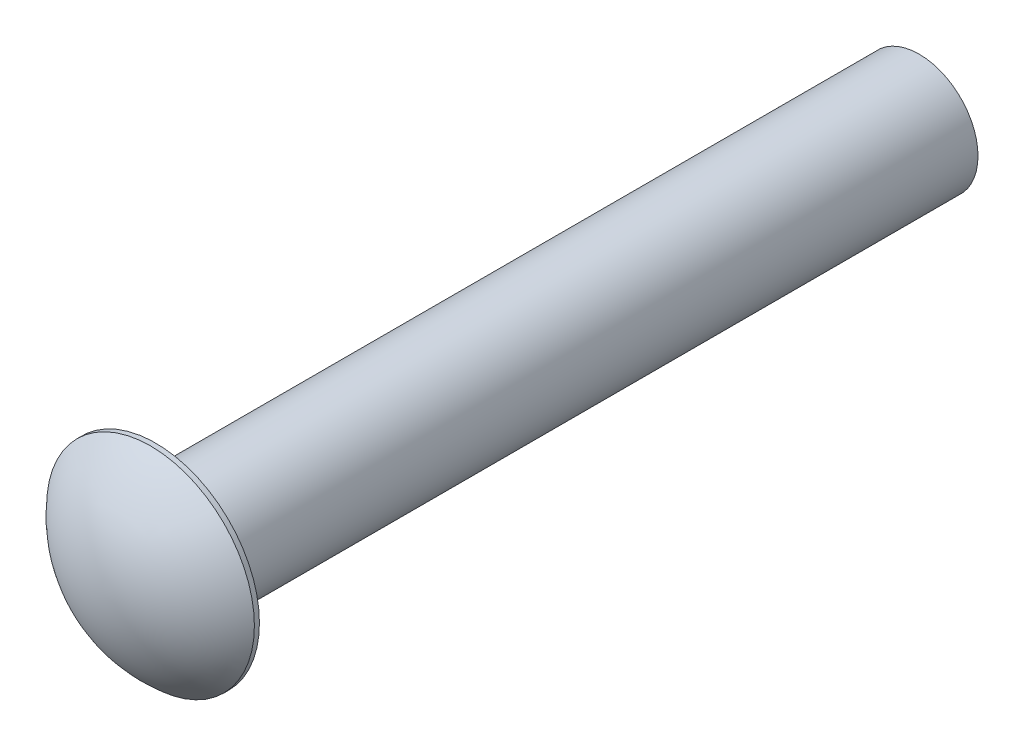
ISO-10303-21;
HEADER;
FILE_DESCRIPTION(('STEP AP214'),'2;1');
FILE_NAME('part.step','',(''),(''),'','','');
FILE_SCHEMA(('AUTOMOTIVE_DESIGN { 1 0 10303 214 1 1 1 1 }'));
ENDSEC;
DATA;
#1=APPLICATION_CONTEXT('core data for automotive mechanical design processes');
#2=APPLICATION_PROTOCOL_DEFINITION('international standard','automotive_design',2000,#1);
#3=PRODUCT_CONTEXT('',#1,'mechanical');
#4=PRODUCT('Part','Part','',(#3));
#5=PRODUCT_RELATED_PRODUCT_CATEGORY('part','',(#4));
#6=PRODUCT_DEFINITION_FORMATION('','',#4);
#7=PRODUCT_DEFINITION_CONTEXT('part definition',#1,'design');
#8=PRODUCT_DEFINITION('design','',#6,#7);
#9=PRODUCT_DEFINITION_SHAPE('','',#8);
#10=(LENGTH_UNIT() NAMED_UNIT(*) SI_UNIT(.MILLI.,.METRE.));
#11=(NAMED_UNIT(*) PLANE_ANGLE_UNIT() SI_UNIT($,.RADIAN.));
#12=(NAMED_UNIT(*) SI_UNIT($,.STERADIAN.) SOLID_ANGLE_UNIT());
#13=UNCERTAINTY_MEASURE_WITH_UNIT(LENGTH_MEASURE(1.E-05),#10,'distance_accuracy_value','');
#14=(GEOMETRIC_REPRESENTATION_CONTEXT(3) GLOBAL_UNCERTAINTY_ASSIGNED_CONTEXT((#13)) GLOBAL_UNIT_ASSIGNED_CONTEXT((#10,
#11,#12)) REPRESENTATION_CONTEXT('',''));
#15=CARTESIAN_POINT('',(0.,0.,0.));
#16=DIRECTION('',(0.,0.,1.));
#17=DIRECTION('',(1.,0.,0.));
#18=AXIS2_PLACEMENT_3D('',#15,#16,#17);
#19=CARTESIAN_POINT('',(0.,0.,0.889));
#20=DIRECTION('',(0.,0.,-1.));
#21=DIRECTION('',(-1.,0.,0.));
#22=AXIS2_PLACEMENT_3D('',#19,#20,#21);
#23=CYLINDRICAL_SURFACE('',#22,1.7272);
#24=CARTESIAN_POINT('',(0.,0.,0.));
#25=DIRECTION('',(0.,0.,1.));
#26=DIRECTION('',(1.,0.,0.));
#27=AXIS2_PLACEMENT_3D('',#24,#25,#26);
#28=CIRCLE('',#27,1.7272);
#29=CARTESIAN_POINT('',(1.7272,0.,0.));
#30=VERTEX_POINT('',#29);
#31=EDGE_CURVE('E38',#30,#30,#28,.T.);
#32=ORIENTED_EDGE('',*,*,#31,.T.);
#33=EDGE_LOOP('',(#32));
#34=FACE_BOUND('',#33,.T.);
#35=CARTESIAN_POINT('',(0.,0.,0.0837386478517008));
#36=DIRECTION('',(0.,0.,1.));
#37=DIRECTION('',(0.,-1.,0.));
#38=AXIS2_PLACEMENT_3D('',#35,#36,#37);
#39=CIRCLE('',#38,1.7272);
#40=CARTESIAN_POINT('',(0.,-1.7272,0.0837386478516992));
#41=VERTEX_POINT('',#40);
#42=EDGE_CURVE('E48',#41,#41,#39,.T.);
#43=ORIENTED_EDGE('',*,*,#42,.F.);
#44=EDGE_LOOP('',(#43));
#45=FACE_BOUND('',#44,.T.);
#46=ADVANCED_FACE('F32',(#34,#45),#23,.T.);
#47=CARTESIAN_POINT('',(0.,0.,0.));
#48=DIRECTION('',(0.,0.,1.));
#49=DIRECTION('',(1.,0.,0.));
#50=AXIS2_PLACEMENT_3D('',#47,#48,#49);
#51=PLANE('',#50);
#52=CARTESIAN_POINT('',(0.,0.,0.));
#53=DIRECTION('',(0.,0.,1.));
#54=DIRECTION('',(1.,0.,0.));
#55=AXIS2_PLACEMENT_3D('',#52,#53,#54);
#56=CIRCLE('',#55,0.9779);
#57=CARTESIAN_POINT('',(0.9779,0.,0.));
#58=VERTEX_POINT('',#57);
#59=EDGE_CURVE('E11',#58,#58,#56,.F.);
#60=ORIENTED_EDGE('',*,*,#59,.F.);
#61=EDGE_LOOP('',(#60));
#62=FACE_BOUND('',#61,.T.);
#63=ORIENTED_EDGE('',*,*,#31,.F.);
#64=EDGE_LOOP('',(#63));
#65=FACE_BOUND('',#64,.T.);
#66=ADVANCED_FACE('F58',(#62,#65),#51,.F.);
#67=CARTESIAN_POINT('',(0.,0.,-12.7));
#68=DIRECTION('',(0.,0.,1.));
#69=DIRECTION('',(1.,0.,0.));
#70=AXIS2_PLACEMENT_3D('',#67,#68,#69);
#71=CYLINDRICAL_SURFACE('',#70,0.9779);
#72=CARTESIAN_POINT('',(0.,0.,-12.7));
#73=DIRECTION('',(0.,0.,-1.));
#74=DIRECTION('',(-1.,0.,0.));
#75=AXIS2_PLACEMENT_3D('',#72,#73,#74);
#76=CIRCLE('',#75,0.9779);
#77=CARTESIAN_POINT('',(-0.9779,0.,-12.7));
#78=VERTEX_POINT('',#77);
#79=EDGE_CURVE('E50',#78,#78,#76,.T.);
#80=ORIENTED_EDGE('',*,*,#79,.F.);
#81=EDGE_LOOP('',(#80));
#82=FACE_BOUND('',#81,.T.);
#83=ORIENTED_EDGE('',*,*,#59,.T.);
#84=EDGE_LOOP('',(#83));
#85=FACE_BOUND('',#84,.T.);
#86=ADVANCED_FACE('F60',(#82,#85),#71,.T.);
#87=CARTESIAN_POINT('',(0.,0.,-12.7));
#88=DIRECTION('',(0.,0.,-1.));
#89=DIRECTION('',(-1.,0.,0.));
#90=AXIS2_PLACEMENT_3D('',#87,#88,#89);
#91=PLANE('',#90);
#92=ORIENTED_EDGE('',*,*,#79,.T.);
#93=EDGE_LOOP('',(#92));
#94=FACE_BOUND('',#93,.T.);
#95=ADVANCED_FACE('F44',(#94),#91,.T.);
#96=CARTESIAN_POINT('',(0.,0.,-1.36596050005271));
#97=DIRECTION('',(0.,0.,1.));
#98=DIRECTION('',(0.,1.,0.));
#99=AXIS2_PLACEMENT_3D('',#96,#97,#98);
#100=SPHERICAL_SURFACE('',#99,2.2549606336774);
#101=CARTESIAN_POINT('',(0.,0.,0.88900013362469));
#102=VERTEX_POINT('',#101);
#103=VERTEX_LOOP('',#102);
#104=FACE_BOUND('',#103,.T.);
#105=ORIENTED_EDGE('',*,*,#42,.T.);
#106=EDGE_LOOP('',(#105));
#107=FACE_BOUND('',#106,.T.);
#108=ADVANCED_FACE('F41',(#104,#107),#100,.T.);
#109=CLOSED_SHELL('',(#46,#66,#86,#95,#108));
#110=MANIFOLD_SOLID_BREP('B2',#109);
#111=ADVANCED_BREP_SHAPE_REPRESENTATION('',(#18,#110),#14);
#112=SHAPE_DEFINITION_REPRESENTATION(#9,#111);
ENDSEC;
END-ISO-10303-21;
